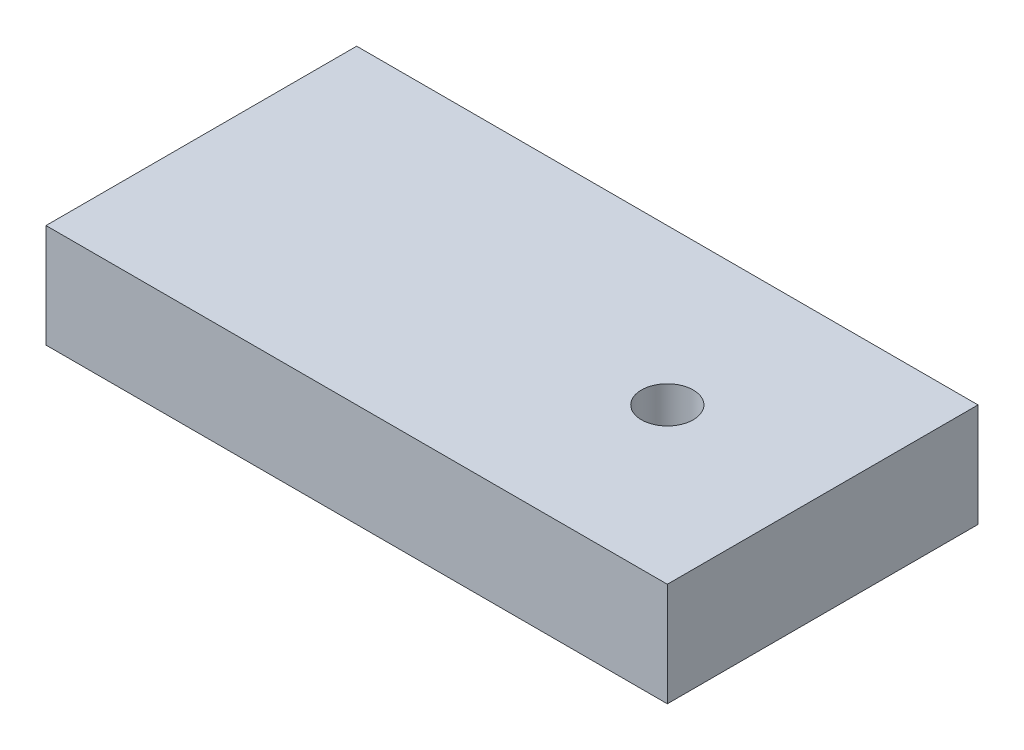
ISO-10303-21;
HEADER;
FILE_DESCRIPTION(('STEP AP214'),'2;1');
FILE_NAME('part.step','',(''),(''),'','','');
FILE_SCHEMA(('AUTOMOTIVE_DESIGN { 1 0 10303 214 1 1 1 1 }'));
ENDSEC;
DATA;
#1=APPLICATION_CONTEXT('core data for automotive mechanical design processes');
#2=APPLICATION_PROTOCOL_DEFINITION('international standard','automotive_design',2000,#1);
#3=PRODUCT_CONTEXT('',#1,'mechanical');
#4=PRODUCT('Part','Part','',(#3));
#5=PRODUCT_RELATED_PRODUCT_CATEGORY('part','',(#4));
#6=PRODUCT_DEFINITION_FORMATION('','',#4);
#7=PRODUCT_DEFINITION_CONTEXT('part definition',#1,'design');
#8=PRODUCT_DEFINITION('design','',#6,#7);
#9=PRODUCT_DEFINITION_SHAPE('','',#8);
#10=(LENGTH_UNIT() NAMED_UNIT(*) SI_UNIT(.MILLI.,.METRE.));
#11=(NAMED_UNIT(*) PLANE_ANGLE_UNIT() SI_UNIT($,.RADIAN.));
#12=(NAMED_UNIT(*) SI_UNIT($,.STERADIAN.) SOLID_ANGLE_UNIT());
#13=UNCERTAINTY_MEASURE_WITH_UNIT(LENGTH_MEASURE(1.E-05),#10,'distance_accuracy_value','');
#14=(GEOMETRIC_REPRESENTATION_CONTEXT(3) GLOBAL_UNCERTAINTY_ASSIGNED_CONTEXT((#13)) GLOBAL_UNIT_ASSIGNED_CONTEXT((#10,
#11,#12)) REPRESENTATION_CONTEXT('',''));
#15=CARTESIAN_POINT('',(0.,0.,0.));
#16=DIRECTION('',(0.,0.,1.));
#17=DIRECTION('',(1.,0.,0.));
#18=AXIS2_PLACEMENT_3D('',#15,#16,#17);
#19=CARTESIAN_POINT('',(57.15,12.7,-19.05));
#20=DIRECTION('',(0.,-1.,0.));
#21=DIRECTION('',(0.,0.,-1.));
#22=AXIS2_PLACEMENT_3D('',#19,#20,#21);
#23=CYLINDRICAL_SURFACE('',#22,3.175);
#24=CARTESIAN_POINT('',(57.15,12.7,-19.05));
#25=DIRECTION('',(0.,-1.,0.));
#26=DIRECTION('',(0.,0.,-1.));
#27=AXIS2_PLACEMENT_3D('',#24,#25,#26);
#28=CIRCLE('',#27,3.175);
#29=CARTESIAN_POINT('',(57.15,12.7,-22.225));
#30=VERTEX_POINT('',#29);
#31=EDGE_CURVE('E119',#30,#30,#28,.T.);
#32=ORIENTED_EDGE('',*,*,#31,.F.);
#33=EDGE_LOOP('',(#32));
#34=FACE_BOUND('',#33,.T.);
#35=CARTESIAN_POINT('',(57.15,3.,-19.05));
#36=DIRECTION('',(0.,-1.,0.));
#37=DIRECTION('',(0.,0.,-1.));
#38=AXIS2_PLACEMENT_3D('',#35,#36,#37);
#39=CIRCLE('',#38,3.175);
#40=CARTESIAN_POINT('',(57.15,3.,-22.225));
#41=VERTEX_POINT('',#40);
#42=EDGE_CURVE('E48',#41,#41,#39,.F.);
#43=ORIENTED_EDGE('',*,*,#42,.F.);
#44=EDGE_LOOP('',(#43));
#45=FACE_BOUND('',#44,.T.);
#46=ADVANCED_FACE('F44',(#34,#45),#23,.F.);
#47=CARTESIAN_POINT('',(0.,12.7,0.));
#48=DIRECTION('',(1.,0.,0.));
#49=DIRECTION('',(0.,0.,-1.));
#50=AXIS2_PLACEMENT_3D('',#47,#48,#49);
#51=PLANE('',#50);
#52=DIRECTION('',(0.,0.,1.));
#53=VECTOR('',#52,1.);
#54=CARTESIAN_POINT('',(0.,0.,0.));
#55=LINE('',#54,#53);
#56=CARTESIAN_POINT('',(0.,0.,-38.1));
#57=VERTEX_POINT('',#56);
#58=CARTESIAN_POINT('',(0.,0.,0.));
#59=VERTEX_POINT('',#58);
#60=EDGE_CURVE('E115',#57,#59,#55,.T.);
#61=ORIENTED_EDGE('',*,*,#60,.T.);
#62=DIRECTION('',(0.,-1.,0.));
#63=VECTOR('',#62,1.);
#64=CARTESIAN_POINT('',(0.,12.7,0.));
#65=LINE('',#64,#63);
#66=CARTESIAN_POINT('',(0.,12.7,0.));
#67=VERTEX_POINT('',#66);
#68=EDGE_CURVE('E11',#67,#59,#65,.T.);
#69=ORIENTED_EDGE('',*,*,#68,.F.);
#70=DIRECTION('',(0.,0.,1.));
#71=VECTOR('',#70,1.);
#72=CARTESIAN_POINT('',(0.,12.7,0.));
#73=LINE('',#72,#71);
#74=CARTESIAN_POINT('',(0.,12.7,-38.1));
#75=VERTEX_POINT('',#74);
#76=EDGE_CURVE('E98',#75,#67,#73,.T.);
#77=ORIENTED_EDGE('',*,*,#76,.F.);
#78=DIRECTION('',(0.,-1.,0.));
#79=VECTOR('',#78,1.);
#80=CARTESIAN_POINT('',(0.,12.7,-38.1));
#81=LINE('',#80,#79);
#82=EDGE_CURVE('E111',#75,#57,#81,.T.);
#83=ORIENTED_EDGE('',*,*,#82,.T.);
#84=EDGE_LOOP('',(#61,#69,#77,#83));
#85=FACE_BOUND('',#84,.T.);
#86=ADVANCED_FACE('F46',(#85),#51,.F.);
#87=CARTESIAN_POINT('',(0.,12.7,0.));
#88=DIRECTION('',(0.,0.,-1.));
#89=DIRECTION('',(-1.,0.,0.));
#90=AXIS2_PLACEMENT_3D('',#87,#88,#89);
#91=PLANE('',#90);
#92=DIRECTION('',(1.,0.,0.));
#93=VECTOR('',#92,1.);
#94=CARTESIAN_POINT('',(0.,0.,0.));
#95=LINE('',#94,#93);
#96=CARTESIAN_POINT('',(76.2,0.,0.));
#97=VERTEX_POINT('',#96);
#98=EDGE_CURVE('E103',#59,#97,#95,.T.);
#99=ORIENTED_EDGE('',*,*,#98,.T.);
#100=DIRECTION('',(0.,-1.,0.));
#101=VECTOR('',#100,1.);
#102=CARTESIAN_POINT('',(76.2,12.7,0.));
#103=LINE('',#102,#101);
#104=CARTESIAN_POINT('',(76.2,12.7,0.));
#105=VERTEX_POINT('',#104);
#106=EDGE_CURVE('E55',#105,#97,#103,.T.);
#107=ORIENTED_EDGE('',*,*,#106,.F.);
#108=DIRECTION('',(1.,0.,0.));
#109=VECTOR('',#108,1.);
#110=CARTESIAN_POINT('',(0.,12.7,0.));
#111=LINE('',#110,#109);
#112=EDGE_CURVE('E93',#67,#105,#111,.T.);
#113=ORIENTED_EDGE('',*,*,#112,.F.);
#114=ORIENTED_EDGE('',*,*,#68,.T.);
#115=EDGE_LOOP('',(#99,#107,#113,#114));
#116=FACE_BOUND('',#115,.T.);
#117=ADVANCED_FACE('F102',(#116),#91,.F.);
#118=CARTESIAN_POINT('',(76.2,12.7,0.));
#119=DIRECTION('',(-1.,0.,0.));
#120=DIRECTION('',(0.,0.,1.));
#121=AXIS2_PLACEMENT_3D('',#118,#119,#120);
#122=PLANE('',#121);
#123=DIRECTION('',(0.,0.,-1.));
#124=VECTOR('',#123,1.);
#125=CARTESIAN_POINT('',(76.2,0.,0.));
#126=LINE('',#125,#124);
#127=CARTESIAN_POINT('',(76.2,0.,-38.1));
#128=VERTEX_POINT('',#127);
#129=EDGE_CURVE('E80',#97,#128,#126,.T.);
#130=ORIENTED_EDGE('',*,*,#129,.T.);
#131=DIRECTION('',(0.,-1.,0.));
#132=VECTOR('',#131,1.);
#133=CARTESIAN_POINT('',(76.2,12.7,-38.1));
#134=LINE('',#133,#132);
#135=CARTESIAN_POINT('',(76.2,12.7,-38.1));
#136=VERTEX_POINT('',#135);
#137=EDGE_CURVE('E105',#136,#128,#134,.T.);
#138=ORIENTED_EDGE('',*,*,#137,.F.);
#139=DIRECTION('',(0.,0.,-1.));
#140=VECTOR('',#139,1.);
#141=CARTESIAN_POINT('',(76.2,12.7,0.));
#142=LINE('',#141,#140);
#143=EDGE_CURVE('E96',#105,#136,#142,.T.);
#144=ORIENTED_EDGE('',*,*,#143,.F.);
#145=ORIENTED_EDGE('',*,*,#106,.T.);
#146=EDGE_LOOP('',(#130,#138,#144,#145));
#147=FACE_BOUND('',#146,.T.);
#148=ADVANCED_FACE('F107',(#147),#122,.F.);
#149=CARTESIAN_POINT('',(0.,12.7,-38.1));
#150=DIRECTION('',(0.,0.,1.));
#151=DIRECTION('',(1.,0.,0.));
#152=AXIS2_PLACEMENT_3D('',#149,#150,#151);
#153=PLANE('',#152);
#154=DIRECTION('',(-1.,0.,0.));
#155=VECTOR('',#154,1.);
#156=CARTESIAN_POINT('',(0.,0.,-38.1));
#157=LINE('',#156,#155);
#158=EDGE_CURVE('E86',#128,#57,#157,.T.);
#159=ORIENTED_EDGE('',*,*,#158,.T.);
#160=ORIENTED_EDGE('',*,*,#82,.F.);
#161=DIRECTION('',(-1.,0.,0.));
#162=VECTOR('',#161,1.);
#163=CARTESIAN_POINT('',(0.,12.7,-38.1));
#164=LINE('',#163,#162);
#165=EDGE_CURVE('E63',#136,#75,#164,.T.);
#166=ORIENTED_EDGE('',*,*,#165,.F.);
#167=ORIENTED_EDGE('',*,*,#137,.T.);
#168=EDGE_LOOP('',(#159,#160,#166,#167));
#169=FACE_BOUND('',#168,.T.);
#170=ADVANCED_FACE('F129',(#169),#153,.F.);
#171=CARTESIAN_POINT('',(0.,12.7,0.));
#172=DIRECTION('',(0.,-1.,0.));
#173=DIRECTION('',(0.,0.,-1.));
#174=AXIS2_PLACEMENT_3D('',#171,#172,#173);
#175=PLANE('',#174);
#176=ORIENTED_EDGE('',*,*,#31,.T.);
#177=EDGE_LOOP('',(#176));
#178=FACE_BOUND('',#177,.T.);
#179=ORIENTED_EDGE('',*,*,#76,.T.);
#180=ORIENTED_EDGE('',*,*,#112,.T.);
#181=ORIENTED_EDGE('',*,*,#143,.T.);
#182=ORIENTED_EDGE('',*,*,#165,.T.);
#183=EDGE_LOOP('',(#179,#180,#181,#182));
#184=FACE_BOUND('',#183,.T.);
#185=ADVANCED_FACE('F94',(#178,#184),#175,.F.);
#186=CARTESIAN_POINT('',(0.,0.,0.));
#187=DIRECTION('',(0.,-1.,0.));
#188=DIRECTION('',(0.,0.,-1.));
#189=AXIS2_PLACEMENT_3D('',#186,#187,#188);
#190=PLANE('',#189);
#191=CARTESIAN_POINT('',(57.15,0.,-19.05));
#192=DIRECTION('',(0.,-1.,0.));
#193=DIRECTION('',(0.,0.,-1.));
#194=AXIS2_PLACEMENT_3D('',#191,#192,#193);
#195=CIRCLE('',#194,6.35);
#196=CARTESIAN_POINT('',(57.15,0.,-25.4));
#197=VERTEX_POINT('',#196);
#198=EDGE_CURVE('E139',#197,#197,#195,.T.);
#199=ORIENTED_EDGE('',*,*,#198,.F.);
#200=EDGE_LOOP('',(#199));
#201=FACE_BOUND('',#200,.T.);
#202=ORIENTED_EDGE('',*,*,#60,.F.);
#203=ORIENTED_EDGE('',*,*,#158,.F.);
#204=ORIENTED_EDGE('',*,*,#129,.F.);
#205=ORIENTED_EDGE('',*,*,#98,.F.);
#206=EDGE_LOOP('',(#202,#203,#204,#205));
#207=FACE_BOUND('',#206,.T.);
#208=ADVANCED_FACE('F132',(#201,#207),#190,.T.);
#209=CARTESIAN_POINT('',(57.15,3.,-19.05));
#210=DIRECTION('',(0.,-1.,0.));
#211=DIRECTION('',(0.,0.,-1.));
#212=AXIS2_PLACEMENT_3D('',#209,#210,#211);
#213=PLANE('',#212);
#214=CARTESIAN_POINT('',(57.15,3.,-19.05));
#215=DIRECTION('',(0.,-1.,0.));
#216=DIRECTION('',(0.,0.,-1.));
#217=AXIS2_PLACEMENT_3D('',#214,#215,#216);
#218=CIRCLE('',#217,6.35);
#219=CARTESIAN_POINT('',(57.15,3.,-25.4));
#220=VERTEX_POINT('',#219);
#221=EDGE_CURVE('E143',#220,#220,#218,.T.);
#222=ORIENTED_EDGE('',*,*,#221,.T.);
#223=EDGE_LOOP('',(#222));
#224=FACE_BOUND('',#223,.T.);
#225=ORIENTED_EDGE('',*,*,#42,.T.);
#226=EDGE_LOOP('',(#225));
#227=FACE_BOUND('',#226,.T.);
#228=ADVANCED_FACE('F152',(#224,#227),#213,.T.);
#229=CARTESIAN_POINT('',(57.15,3.,-19.05));
#230=DIRECTION('',(0.,-1.,0.));
#231=DIRECTION('',(0.,0.,-1.));
#232=AXIS2_PLACEMENT_3D('',#229,#230,#231);
#233=CYLINDRICAL_SURFACE('',#232,6.35);
#234=ORIENTED_EDGE('',*,*,#221,.F.);
#235=EDGE_LOOP('',(#234));
#236=FACE_BOUND('',#235,.T.);
#237=ORIENTED_EDGE('',*,*,#198,.T.);
#238=EDGE_LOOP('',(#237));
#239=FACE_BOUND('',#238,.T.);
#240=ADVANCED_FACE('F165',(#236,#239),#233,.F.);
#241=CLOSED_SHELL('',(#46,#86,#117,#148,#170,#185,#208,#228,#240));
#242=MANIFOLD_SOLID_BREP('B2',#241);
#243=ADVANCED_BREP_SHAPE_REPRESENTATION('',(#18,#242),#14);
#244=SHAPE_DEFINITION_REPRESENTATION(#9,#243);
ENDSEC;
END-ISO-10303-21;
